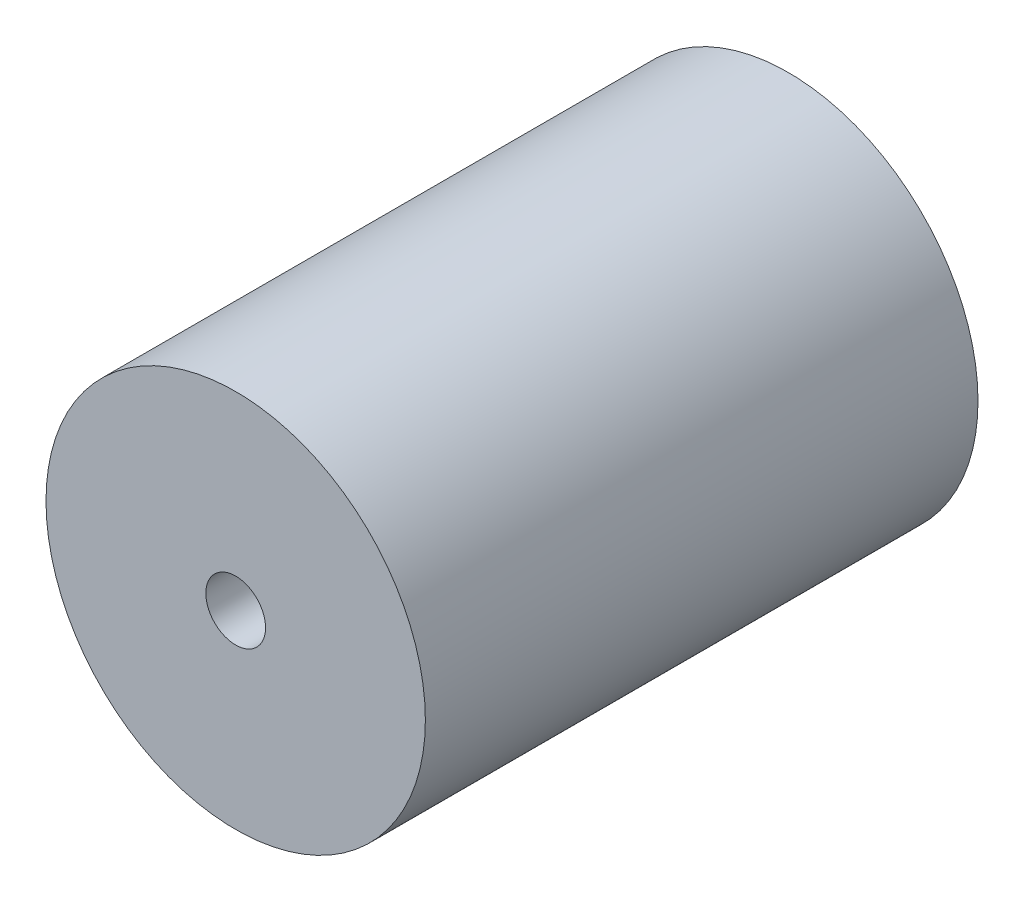
ISO-10303-21;
HEADER;
FILE_DESCRIPTION(('STEP AP214'),'2;1');
FILE_NAME('part.step','',(''),(''),'','','');
FILE_SCHEMA(('AUTOMOTIVE_DESIGN { 1 0 10303 214 1 1 1 1 }'));
ENDSEC;
DATA;
#1=APPLICATION_CONTEXT('core data for automotive mechanical design processes');
#2=APPLICATION_PROTOCOL_DEFINITION('international standard','automotive_design',2000,#1);
#3=PRODUCT_CONTEXT('',#1,'mechanical');
#4=PRODUCT('Part','Part','',(#3));
#5=PRODUCT_RELATED_PRODUCT_CATEGORY('part','',(#4));
#6=PRODUCT_DEFINITION_FORMATION('','',#4);
#7=PRODUCT_DEFINITION_CONTEXT('part definition',#1,'design');
#8=PRODUCT_DEFINITION('design','',#6,#7);
#9=PRODUCT_DEFINITION_SHAPE('','',#8);
#10=(LENGTH_UNIT() NAMED_UNIT(*) SI_UNIT(.MILLI.,.METRE.));
#11=(NAMED_UNIT(*) PLANE_ANGLE_UNIT() SI_UNIT($,.RADIAN.));
#12=(NAMED_UNIT(*) SI_UNIT($,.STERADIAN.) SOLID_ANGLE_UNIT());
#13=UNCERTAINTY_MEASURE_WITH_UNIT(LENGTH_MEASURE(1.E-05),#10,'distance_accuracy_value','');
#14=(GEOMETRIC_REPRESENTATION_CONTEXT(3) GLOBAL_UNCERTAINTY_ASSIGNED_CONTEXT((#13)) GLOBAL_UNIT_ASSIGNED_CONTEXT((#10,
#11,#12)) REPRESENTATION_CONTEXT('',''));
#15=CARTESIAN_POINT('',(0.,0.,0.));
#16=DIRECTION('',(0.,0.,1.));
#17=DIRECTION('',(1.,0.,0.));
#18=AXIS2_PLACEMENT_3D('',#15,#16,#17);
#19=CARTESIAN_POINT('',(0.,0.,37.));
#20=DIRECTION('',(0.,0.,-1.));
#21=DIRECTION('',(-1.,0.,0.));
#22=AXIS2_PLACEMENT_3D('',#19,#20,#21);
#23=CYLINDRICAL_SURFACE('',#22,4.);
#24=CARTESIAN_POINT('',(0.,0.,37.));
#25=DIRECTION('',(0.,0.,1.));
#26=DIRECTION('',(1.,0.,0.));
#27=AXIS2_PLACEMENT_3D('',#24,#25,#26);
#28=CIRCLE('',#27,4.);
#29=CARTESIAN_POINT('',(4.,0.,37.));
#30=VERTEX_POINT('',#29);
#31=EDGE_CURVE('E47',#30,#30,#28,.T.);
#32=ORIENTED_EDGE('',*,*,#31,.T.);
#33=EDGE_LOOP('',(#32));
#34=FACE_BOUND('',#33,.T.);
#35=CARTESIAN_POINT('',(0.,0.,-37.));
#36=DIRECTION('',(0.,0.,1.));
#37=DIRECTION('',(1.,0.,0.));
#38=AXIS2_PLACEMENT_3D('',#35,#36,#37);
#39=CIRCLE('',#38,4.);
#40=CARTESIAN_POINT('',(4.,0.,-37.));
#41=VERTEX_POINT('',#40);
#42=EDGE_CURVE('E54',#41,#41,#39,.T.);
#43=ORIENTED_EDGE('',*,*,#42,.F.);
#44=EDGE_LOOP('',(#43));
#45=FACE_BOUND('',#44,.T.);
#46=ADVANCED_FACE('F39',(#34,#45),#23,.F.);
#47=CARTESIAN_POINT('',(0.,0.,37.));
#48=DIRECTION('',(0.,0.,-1.));
#49=DIRECTION('',(-1.,0.,0.));
#50=AXIS2_PLACEMENT_3D('',#47,#48,#49);
#51=CYLINDRICAL_SURFACE('',#50,25.4);
#52=CARTESIAN_POINT('',(0.,0.,37.));
#53=DIRECTION('',(0.,0.,1.));
#54=DIRECTION('',(1.,0.,0.));
#55=AXIS2_PLACEMENT_3D('',#52,#53,#54);
#56=CIRCLE('',#55,25.4);
#57=CARTESIAN_POINT('',(25.4,0.,37.));
#58=VERTEX_POINT('',#57);
#59=EDGE_CURVE('E10',#58,#58,#56,.T.);
#60=ORIENTED_EDGE('',*,*,#59,.F.);
#61=EDGE_LOOP('',(#60));
#62=FACE_BOUND('',#61,.T.);
#63=CARTESIAN_POINT('',(0.,0.,-37.));
#64=DIRECTION('',(0.,0.,1.));
#65=DIRECTION('',(1.,0.,0.));
#66=AXIS2_PLACEMENT_3D('',#63,#64,#65);
#67=CIRCLE('',#66,25.4);
#68=CARTESIAN_POINT('',(25.4,0.,-37.));
#69=VERTEX_POINT('',#68);
#70=EDGE_CURVE('E42',#69,#69,#67,.T.);
#71=ORIENTED_EDGE('',*,*,#70,.T.);
#72=EDGE_LOOP('',(#71));
#73=FACE_BOUND('',#72,.T.);
#74=ADVANCED_FACE('F63',(#62,#73),#51,.T.);
#75=CARTESIAN_POINT('',(0.,0.,37.));
#76=DIRECTION('',(0.,0.,1.));
#77=DIRECTION('',(1.,0.,0.));
#78=AXIS2_PLACEMENT_3D('',#75,#76,#77);
#79=PLANE('',#78);
#80=ORIENTED_EDGE('',*,*,#31,.F.);
#81=EDGE_LOOP('',(#80));
#82=FACE_BOUND('',#81,.T.);
#83=ORIENTED_EDGE('',*,*,#59,.T.);
#84=EDGE_LOOP('',(#83));
#85=FACE_BOUND('',#84,.T.);
#86=ADVANCED_FACE('F67',(#82,#85),#79,.T.);
#87=CARTESIAN_POINT('',(0.,0.,-37.));
#88=DIRECTION('',(0.,0.,1.));
#89=DIRECTION('',(1.,0.,0.));
#90=AXIS2_PLACEMENT_3D('',#87,#88,#89);
#91=PLANE('',#90);
#92=ORIENTED_EDGE('',*,*,#42,.T.);
#93=EDGE_LOOP('',(#92));
#94=FACE_BOUND('',#93,.T.);
#95=ORIENTED_EDGE('',*,*,#70,.F.);
#96=EDGE_LOOP('',(#95));
#97=FACE_BOUND('',#96,.T.);
#98=ADVANCED_FACE('F65',(#94,#97),#91,.F.);
#99=CLOSED_SHELL('',(#46,#74,#86,#98));
#100=MANIFOLD_SOLID_BREP('B2',#99);
#101=ADVANCED_BREP_SHAPE_REPRESENTATION('',(#18,#100),#14);
#102=SHAPE_DEFINITION_REPRESENTATION(#9,#101);
ENDSEC;
END-ISO-10303-21;
